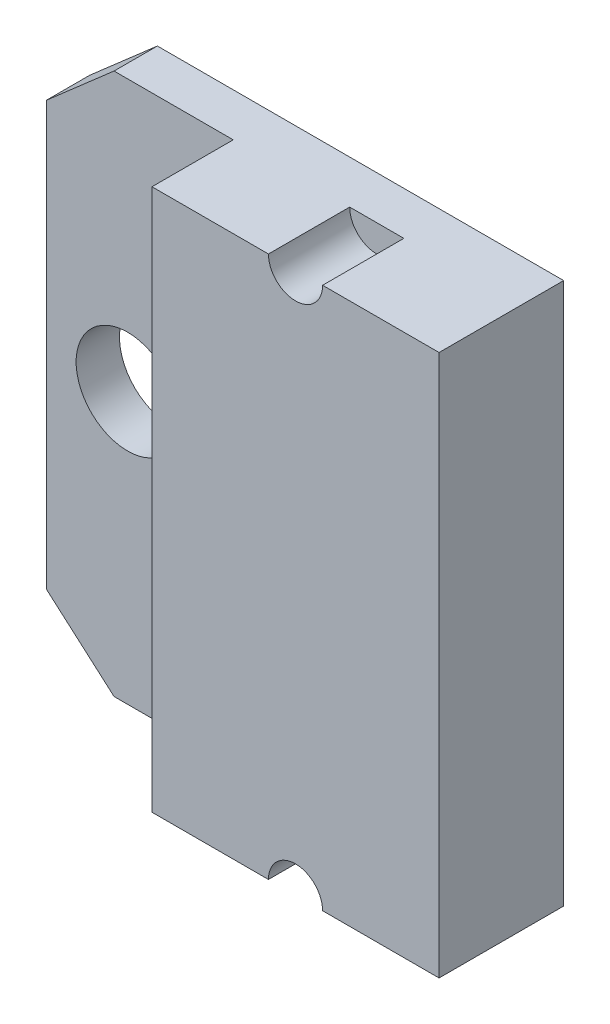
ISO-10303-21;
HEADER;
FILE_DESCRIPTION(('STEP AP214'),'2;1');
FILE_NAME('part.step','',(''),(''),'','','');
FILE_SCHEMA(('AUTOMOTIVE_DESIGN { 1 0 10303 214 1 1 1 1 }'));
ENDSEC;
DATA;
#1=APPLICATION_CONTEXT('core data for automotive mechanical design processes');
#2=APPLICATION_PROTOCOL_DEFINITION('international standard','automotive_design',2000,#1);
#3=PRODUCT_CONTEXT('',#1,'mechanical');
#4=PRODUCT('Part','Part','',(#3));
#5=PRODUCT_RELATED_PRODUCT_CATEGORY('part','',(#4));
#6=PRODUCT_DEFINITION_FORMATION('','',#4);
#7=PRODUCT_DEFINITION_CONTEXT('part definition',#1,'design');
#8=PRODUCT_DEFINITION('design','',#6,#7);
#9=PRODUCT_DEFINITION_SHAPE('','',#8);
#10=(LENGTH_UNIT() NAMED_UNIT(*) SI_UNIT(.MILLI.,.METRE.));
#11=(NAMED_UNIT(*) PLANE_ANGLE_UNIT() SI_UNIT($,.RADIAN.));
#12=(NAMED_UNIT(*) SI_UNIT($,.STERADIAN.) SOLID_ANGLE_UNIT());
#13=UNCERTAINTY_MEASURE_WITH_UNIT(LENGTH_MEASURE(1.E-05),#10,'distance_accuracy_value','');
#14=(GEOMETRIC_REPRESENTATION_CONTEXT(3) GLOBAL_UNCERTAINTY_ASSIGNED_CONTEXT((#13)) GLOBAL_UNIT_ASSIGNED_CONTEXT((#10,
#11,#12)) REPRESENTATION_CONTEXT('',''));
#15=CARTESIAN_POINT('',(0.,0.,0.));
#16=DIRECTION('',(0.,0.,1.));
#17=DIRECTION('',(1.,0.,0.));
#18=AXIS2_PLACEMENT_3D('',#15,#16,#17);
#19=CARTESIAN_POINT('',(0.,0.,1.6));
#20=DIRECTION('',(0.,0.,1.));
#21=DIRECTION('',(1.,0.,0.));
#22=AXIS2_PLACEMENT_3D('',#19,#20,#21);
#23=PLANE('',#22);
#24=DIRECTION('',(0.,-1.,0.));
#25=VECTOR('',#24,1.);
#26=CARTESIAN_POINT('',(-0.599999999999998,8.65,1.6));
#27=LINE('',#26,#25);
#28=CARTESIAN_POINT('',(-0.599999999999998,8.65,1.6));
#29=VERTEX_POINT('',#28);
#30=CARTESIAN_POINT('',(-0.599999999999997,-11.35,1.6));
#31=VERTEX_POINT('',#30);
#32=EDGE_CURVE('E146',#29,#31,#27,.T.);
#33=ORIENTED_EDGE('',*,*,#32,.F.);
#34=DIRECTION('',(-1.,0.,0.));
#35=VECTOR('',#34,1.);
#36=CARTESIAN_POINT('',(10.,8.65,1.6));
#37=LINE('',#36,#35);
#38=CARTESIAN_POINT('',(-5.,8.65,1.6));
#39=VERTEX_POINT('',#38);
#40=EDGE_CURVE('E174',#29,#39,#37,.T.);
#41=ORIENTED_EDGE('',*,*,#40,.T.);
#42=DIRECTION('',(-0.75294294979712,-0.658085795585052,0.));
#43=VECTOR('',#42,1.);
#44=CARTESIAN_POINT('',(-7.5,6.46495465306378,1.6));
#45=LINE('',#44,#43);
#46=CARTESIAN_POINT('',(-7.5,6.46495465306378,1.6));
#47=VERTEX_POINT('',#46);
#48=EDGE_CURVE('E176',#39,#47,#45,.T.);
#49=ORIENTED_EDGE('',*,*,#48,.T.);
#50=DIRECTION('',(0.,-1.,0.));
#51=VECTOR('',#50,1.);
#52=CARTESIAN_POINT('',(-7.5,-9.16495465306377,1.6));
#53=LINE('',#52,#51);
#54=CARTESIAN_POINT('',(-7.5,-9.16495465306377,1.6));
#55=VERTEX_POINT('',#54);
#56=EDGE_CURVE('E179',#47,#55,#53,.T.);
#57=ORIENTED_EDGE('',*,*,#56,.T.);
#58=DIRECTION('',(0.75294294979712,-0.658085795585053,0.));
#59=VECTOR('',#58,1.);
#60=CARTESIAN_POINT('',(-7.5,-9.16495465306377,1.6));
#61=LINE('',#60,#59);
#62=CARTESIAN_POINT('',(-5.,-11.35,1.6));
#63=VERTEX_POINT('',#62);
#64=EDGE_CURVE('E181',#55,#63,#61,.T.);
#65=ORIENTED_EDGE('',*,*,#64,.T.);
#66=DIRECTION('',(1.,0.,0.));
#67=VECTOR('',#66,1.);
#68=CARTESIAN_POINT('',(10.,-11.35,1.6));
#69=LINE('',#68,#67);
#70=EDGE_CURVE('E183',#63,#31,#69,.T.);
#71=ORIENTED_EDGE('',*,*,#70,.T.);
#72=EDGE_LOOP('',(#33,#41,#49,#57,#65,#71));
#73=FACE_BOUND('',#72,.T.);
#74=CARTESIAN_POINT('',(-4.5,-1.35,1.6));
#75=DIRECTION('',(0.,0.,1.));
#76=DIRECTION('',(1.,0.,0.));
#77=AXIS2_PLACEMENT_3D('',#74,#75,#76);
#78=CIRCLE('',#77,1.9);
#79=CARTESIAN_POINT('',(-2.6,-1.35,1.6));
#80=VERTEX_POINT('',#79);
#81=EDGE_CURVE('E168',#80,#80,#78,.T.);
#82=ORIENTED_EDGE('',*,*,#81,.F.);
#83=EDGE_LOOP('',(#82));
#84=FACE_BOUND('',#83,.T.);
#85=ADVANCED_FACE('F32',(#73,#84),#23,.T.);
#86=CARTESIAN_POINT('',(0.,0.,0.));
#87=DIRECTION('',(0.,0.,1.));
#88=DIRECTION('',(1.,0.,0.));
#89=AXIS2_PLACEMENT_3D('',#86,#87,#88);
#90=PLANE('',#89);
#91=DIRECTION('',(0.,1.,0.));
#92=VECTOR('',#91,1.);
#93=CARTESIAN_POINT('',(10.,-11.35,0.));
#94=LINE('',#93,#92);
#95=CARTESIAN_POINT('',(10.,-11.35,0.));
#96=VERTEX_POINT('',#95);
#97=CARTESIAN_POINT('',(10.,8.65,0.));
#98=VERTEX_POINT('',#97);
#99=EDGE_CURVE('E171',#96,#98,#94,.T.);
#100=ORIENTED_EDGE('',*,*,#99,.F.);
#101=DIRECTION('',(1.,0.,0.));
#102=VECTOR('',#101,1.);
#103=CARTESIAN_POINT('',(10.,-11.35,0.));
#104=LINE('',#103,#102);
#105=CARTESIAN_POINT('',(-5.,-11.35,0.));
#106=VERTEX_POINT('',#105);
#107=EDGE_CURVE('E177',#106,#96,#104,.T.);
#108=ORIENTED_EDGE('',*,*,#107,.F.);
#109=DIRECTION('',(0.75294294979712,-0.658085795585053,0.));
#110=VECTOR('',#109,1.);
#111=CARTESIAN_POINT('',(-7.5,-9.16495465306377,0.));
#112=LINE('',#111,#110);
#113=CARTESIAN_POINT('',(-7.5,-9.16495465306377,0.));
#114=VERTEX_POINT('',#113);
#115=EDGE_CURVE('E194',#114,#106,#112,.T.);
#116=ORIENTED_EDGE('',*,*,#115,.F.);
#117=DIRECTION('',(0.,-1.,0.));
#118=VECTOR('',#117,1.);
#119=CARTESIAN_POINT('',(-7.5,-9.16495465306377,0.));
#120=LINE('',#119,#118);
#121=CARTESIAN_POINT('',(-7.5,6.46495465306378,0.));
#122=VERTEX_POINT('',#121);
#123=EDGE_CURVE('E192',#122,#114,#120,.T.);
#124=ORIENTED_EDGE('',*,*,#123,.F.);
#125=DIRECTION('',(-0.75294294979712,-0.658085795585052,0.));
#126=VECTOR('',#125,1.);
#127=CARTESIAN_POINT('',(-7.5,6.46495465306378,0.));
#128=LINE('',#127,#126);
#129=CARTESIAN_POINT('',(-5.,8.65,0.));
#130=VERTEX_POINT('',#129);
#131=EDGE_CURVE('E190',#130,#122,#128,.T.);
#132=ORIENTED_EDGE('',*,*,#131,.F.);
#133=DIRECTION('',(-1.,0.,0.));
#134=VECTOR('',#133,1.);
#135=CARTESIAN_POINT('',(10.,8.65,0.));
#136=LINE('',#135,#134);
#137=EDGE_CURVE('E188',#98,#130,#136,.T.);
#138=ORIENTED_EDGE('',*,*,#137,.F.);
#139=EDGE_LOOP('',(#100,#108,#116,#124,#132,#138));
#140=FACE_BOUND('',#139,.T.);
#141=CARTESIAN_POINT('',(-4.5,-1.35,0.));
#142=DIRECTION('',(0.,0.,1.));
#143=DIRECTION('',(1.,0.,0.));
#144=AXIS2_PLACEMENT_3D('',#141,#142,#143);
#145=CIRCLE('',#144,1.9);
#146=CARTESIAN_POINT('',(-2.6,-1.35,0.));
#147=VERTEX_POINT('',#146);
#148=EDGE_CURVE('E167',#147,#147,#145,.T.);
#149=ORIENTED_EDGE('',*,*,#148,.T.);
#150=EDGE_LOOP('',(#149));
#151=FACE_BOUND('',#150,.T.);
#152=ADVANCED_FACE('F253',(#140,#151),#90,.F.);
#153=CARTESIAN_POINT('',(10.,-11.35,1.6));
#154=DIRECTION('',(-1.,0.,0.));
#155=DIRECTION('',(0.,0.,1.));
#156=AXIS2_PLACEMENT_3D('',#153,#154,#155);
#157=PLANE('',#156);
#158=ORIENTED_EDGE('',*,*,#99,.T.);
#159=DIRECTION('',(0.,0.,-1.));
#160=VECTOR('',#159,1.);
#161=CARTESIAN_POINT('',(10.,8.65,1.6));
#162=LINE('',#161,#160);
#163=CARTESIAN_POINT('',(10.,8.65,4.6));
#164=VERTEX_POINT('',#163);
#165=EDGE_CURVE('E211',#164,#98,#162,.T.);
#166=ORIENTED_EDGE('',*,*,#165,.F.);
#167=DIRECTION('',(0.,1.,0.));
#168=VECTOR('',#167,1.);
#169=CARTESIAN_POINT('',(10.,8.65,4.6));
#170=LINE('',#169,#168);
#171=CARTESIAN_POINT('',(10.,-11.35,4.6));
#172=VERTEX_POINT('',#171);
#173=EDGE_CURVE('E147',#172,#164,#170,.T.);
#174=ORIENTED_EDGE('',*,*,#173,.F.);
#175=DIRECTION('',(0.,0.,-1.));
#176=VECTOR('',#175,1.);
#177=CARTESIAN_POINT('',(10.,-11.35,1.6));
#178=LINE('',#177,#176);
#179=EDGE_CURVE('E185',#172,#96,#178,.T.);
#180=ORIENTED_EDGE('',*,*,#179,.T.);
#181=EDGE_LOOP('',(#158,#166,#174,#180));
#182=FACE_BOUND('',#181,.T.);
#183=ADVANCED_FACE('F34',(#182),#157,.F.);
#184=CARTESIAN_POINT('',(10.,8.65,1.6));
#185=DIRECTION('',(0.,-1.,0.));
#186=DIRECTION('',(1.,0.,0.));
#187=AXIS2_PLACEMENT_3D('',#184,#185,#186);
#188=PLANE('',#187);
#189=DIRECTION('',(1.,0.,0.));
#190=VECTOR('',#189,1.);
#191=CARTESIAN_POINT('',(10.,8.65,1.6));
#192=LINE('',#191,#190);
#193=CARTESIAN_POINT('',(3.7,8.65,1.6));
#194=VERTEX_POINT('',#193);
#195=CARTESIAN_POINT('',(5.7,8.65,1.6));
#196=VERTEX_POINT('',#195);
#197=EDGE_CURVE('E11',#194,#196,#192,.T.);
#198=ORIENTED_EDGE('',*,*,#197,.T.);
#199=DIRECTION('',(0.,0.,1.));
#200=VECTOR('',#199,1.);
#201=CARTESIAN_POINT('',(5.7,8.65,1.6));
#202=LINE('',#201,#200);
#203=CARTESIAN_POINT('',(5.7,8.65,4.6));
#204=VERTEX_POINT('',#203);
#205=EDGE_CURVE('E127',#196,#204,#202,.T.);
#206=ORIENTED_EDGE('',*,*,#205,.T.);
#207=DIRECTION('',(-1.,0.,0.));
#208=VECTOR('',#207,1.);
#209=CARTESIAN_POINT('',(10.,8.65,4.6));
#210=LINE('',#209,#208);
#211=EDGE_CURVE('E150',#164,#204,#210,.T.);
#212=ORIENTED_EDGE('',*,*,#211,.F.);
#213=ORIENTED_EDGE('',*,*,#165,.T.);
#214=ORIENTED_EDGE('',*,*,#137,.T.);
#215=DIRECTION('',(0.,0.,-1.));
#216=VECTOR('',#215,1.);
#217=CARTESIAN_POINT('',(-5.,8.65,1.6));
#218=LINE('',#217,#216);
#219=EDGE_CURVE('E208',#39,#130,#218,.T.);
#220=ORIENTED_EDGE('',*,*,#219,.F.);
#221=ORIENTED_EDGE('',*,*,#40,.F.);
#222=DIRECTION('',(0.,0.,-1.));
#223=VECTOR('',#222,1.);
#224=CARTESIAN_POINT('',(-0.599999999999998,8.65,4.6));
#225=LINE('',#224,#223);
#226=CARTESIAN_POINT('',(-0.599999999999998,8.65,4.6));
#227=VERTEX_POINT('',#226);
#228=EDGE_CURVE('E164',#227,#29,#225,.T.);
#229=ORIENTED_EDGE('',*,*,#228,.F.);
#230=CARTESIAN_POINT('',(3.7,8.65,4.6));
#231=VERTEX_POINT('',#230);
#232=EDGE_CURVE('E134',#231,#227,#210,.T.);
#233=ORIENTED_EDGE('',*,*,#232,.F.);
#234=DIRECTION('',(0.,0.,1.));
#235=VECTOR('',#234,1.);
#236=CARTESIAN_POINT('',(3.7,8.65,1.6));
#237=LINE('',#236,#235);
#238=EDGE_CURVE('E55',#231,#194,#237,.F.);
#239=ORIENTED_EDGE('',*,*,#238,.T.);
#240=EDGE_LOOP('',(#198,#206,#212,#213,#214,#220,#221,#229,#233,#239));
#241=FACE_BOUND('',#240,.T.);
#242=ADVANCED_FACE('F132',(#241),#188,.F.);
#243=CARTESIAN_POINT('',(-7.5,6.46495465306378,1.6));
#244=DIRECTION('',(0.658085795585053,-0.75294294979712,0.));
#245=DIRECTION('',(0.75294294979712,0.658085795585053,0.));
#246=AXIS2_PLACEMENT_3D('',#243,#244,#245);
#247=PLANE('',#246);
#248=ORIENTED_EDGE('',*,*,#131,.T.);
#249=DIRECTION('',(0.,0.,-1.));
#250=VECTOR('',#249,1.);
#251=CARTESIAN_POINT('',(-7.5,6.46495465306378,1.6));
#252=LINE('',#251,#250);
#253=EDGE_CURVE('E205',#47,#122,#252,.T.);
#254=ORIENTED_EDGE('',*,*,#253,.F.);
#255=ORIENTED_EDGE('',*,*,#48,.F.);
#256=ORIENTED_EDGE('',*,*,#219,.T.);
#257=EDGE_LOOP('',(#248,#254,#255,#256));
#258=FACE_BOUND('',#257,.T.);
#259=ADVANCED_FACE('F239',(#258),#247,.F.);
#260=CARTESIAN_POINT('',(-7.5,-9.16495465306377,1.6));
#261=DIRECTION('',(1.,0.,0.));
#262=DIRECTION('',(0.,0.,-1.));
#263=AXIS2_PLACEMENT_3D('',#260,#261,#262);
#264=PLANE('',#263);
#265=ORIENTED_EDGE('',*,*,#123,.T.);
#266=DIRECTION('',(0.,0.,-1.));
#267=VECTOR('',#266,1.);
#268=CARTESIAN_POINT('',(-7.5,-9.16495465306377,1.6));
#269=LINE('',#268,#267);
#270=EDGE_CURVE('E202',#55,#114,#269,.T.);
#271=ORIENTED_EDGE('',*,*,#270,.F.);
#272=ORIENTED_EDGE('',*,*,#56,.F.);
#273=ORIENTED_EDGE('',*,*,#253,.T.);
#274=EDGE_LOOP('',(#265,#271,#272,#273));
#275=FACE_BOUND('',#274,.T.);
#276=ADVANCED_FACE('F245',(#275),#264,.F.);
#277=CARTESIAN_POINT('',(-7.5,-9.16495465306377,1.6));
#278=DIRECTION('',(0.658085795585053,0.75294294979712,0.));
#279=DIRECTION('',(-0.75294294979712,0.658085795585053,0.));
#280=AXIS2_PLACEMENT_3D('',#277,#278,#279);
#281=PLANE('',#280);
#282=ORIENTED_EDGE('',*,*,#115,.T.);
#283=DIRECTION('',(0.,0.,-1.));
#284=VECTOR('',#283,1.);
#285=CARTESIAN_POINT('',(-5.,-11.35,1.6));
#286=LINE('',#285,#284);
#287=EDGE_CURVE('E199',#63,#106,#286,.T.);
#288=ORIENTED_EDGE('',*,*,#287,.F.);
#289=ORIENTED_EDGE('',*,*,#64,.F.);
#290=ORIENTED_EDGE('',*,*,#270,.T.);
#291=EDGE_LOOP('',(#282,#288,#289,#290));
#292=FACE_BOUND('',#291,.T.);
#293=ADVANCED_FACE('F249',(#292),#281,.F.);
#294=CARTESIAN_POINT('',(10.,-11.35,1.6));
#295=DIRECTION('',(0.,1.,0.));
#296=DIRECTION('',(0.,0.,1.));
#297=AXIS2_PLACEMENT_3D('',#294,#295,#296);
#298=PLANE('',#297);
#299=DIRECTION('',(1.,0.,0.));
#300=VECTOR('',#299,1.);
#301=CARTESIAN_POINT('',(10.,-11.35,1.6));
#302=LINE('',#301,#300);
#303=CARTESIAN_POINT('',(3.7,-11.35,1.6));
#304=VERTEX_POINT('',#303);
#305=CARTESIAN_POINT('',(5.7,-11.35,1.6));
#306=VERTEX_POINT('',#305);
#307=EDGE_CURVE('E40',#304,#306,#302,.T.);
#308=ORIENTED_EDGE('',*,*,#307,.F.);
#309=DIRECTION('',(0.,0.,1.));
#310=VECTOR('',#309,1.);
#311=CARTESIAN_POINT('',(3.7,-11.35,1.6));
#312=LINE('',#311,#310);
#313=CARTESIAN_POINT('',(3.7,-11.35,4.6));
#314=VERTEX_POINT('',#313);
#315=EDGE_CURVE('E143',#304,#314,#312,.T.);
#316=ORIENTED_EDGE('',*,*,#315,.T.);
#317=DIRECTION('',(1.,0.,0.));
#318=VECTOR('',#317,1.);
#319=CARTESIAN_POINT('',(10.,-11.35,4.6));
#320=LINE('',#319,#318);
#321=CARTESIAN_POINT('',(-0.599999999999997,-11.35,4.6));
#322=VERTEX_POINT('',#321);
#323=EDGE_CURVE('E156',#322,#314,#320,.T.);
#324=ORIENTED_EDGE('',*,*,#323,.F.);
#325=DIRECTION('',(0.,0.,-1.));
#326=VECTOR('',#325,1.);
#327=CARTESIAN_POINT('',(-0.599999999999997,-11.35,4.6));
#328=LINE('',#327,#326);
#329=EDGE_CURVE('E159',#322,#31,#328,.T.);
#330=ORIENTED_EDGE('',*,*,#329,.T.);
#331=ORIENTED_EDGE('',*,*,#70,.F.);
#332=ORIENTED_EDGE('',*,*,#287,.T.);
#333=ORIENTED_EDGE('',*,*,#107,.T.);
#334=ORIENTED_EDGE('',*,*,#179,.F.);
#335=CARTESIAN_POINT('',(5.7,-11.35,4.6));
#336=VERTEX_POINT('',#335);
#337=EDGE_CURVE('E155',#336,#172,#320,.T.);
#338=ORIENTED_EDGE('',*,*,#337,.F.);
#339=DIRECTION('',(0.,0.,1.));
#340=VECTOR('',#339,1.);
#341=CARTESIAN_POINT('',(5.7,-11.35,1.6));
#342=LINE('',#341,#340);
#343=EDGE_CURVE('E47',#336,#306,#342,.F.);
#344=ORIENTED_EDGE('',*,*,#343,.T.);
#345=EDGE_LOOP('',(#308,#316,#324,#330,#331,#332,#333,#334,#338,#344));
#346=FACE_BOUND('',#345,.T.);
#347=ADVANCED_FACE('F219',(#346),#298,.F.);
#348=CARTESIAN_POINT('',(-4.5,-1.35,1.6));
#349=DIRECTION('',(0.,0.,-1.));
#350=DIRECTION('',(-1.,0.,0.));
#351=AXIS2_PLACEMENT_3D('',#348,#349,#350);
#352=CYLINDRICAL_SURFACE('',#351,1.9);
#353=ORIENTED_EDGE('',*,*,#81,.T.);
#354=EDGE_LOOP('',(#353));
#355=FACE_BOUND('',#354,.T.);
#356=ORIENTED_EDGE('',*,*,#148,.F.);
#357=EDGE_LOOP('',(#356));
#358=FACE_BOUND('',#357,.T.);
#359=ADVANCED_FACE('F268',(#355,#358),#352,.F.);
#360=CARTESIAN_POINT('',(-0.599999999999998,8.65,4.6));
#361=DIRECTION('',(1.,0.,0.));
#362=DIRECTION('',(0.,1.,0.));
#363=AXIS2_PLACEMENT_3D('',#360,#361,#362);
#364=PLANE('',#363);
#365=ORIENTED_EDGE('',*,*,#32,.T.);
#366=ORIENTED_EDGE('',*,*,#329,.F.);
#367=DIRECTION('',(0.,-1.,0.));
#368=VECTOR('',#367,1.);
#369=CARTESIAN_POINT('',(-0.599999999999998,8.65,4.6));
#370=LINE('',#369,#368);
#371=EDGE_CURVE('E153',#227,#322,#370,.T.);
#372=ORIENTED_EDGE('',*,*,#371,.F.);
#373=ORIENTED_EDGE('',*,*,#228,.T.);
#374=EDGE_LOOP('',(#365,#366,#372,#373));
#375=FACE_BOUND('',#374,.T.);
#376=ADVANCED_FACE('F230',(#375),#364,.F.);
#377=CARTESIAN_POINT('',(0.,0.,4.6));
#378=DIRECTION('',(0.,0.,-1.));
#379=DIRECTION('',(-1.,0.,0.));
#380=AXIS2_PLACEMENT_3D('',#377,#378,#379);
#381=PLANE('',#380);
#382=ORIENTED_EDGE('',*,*,#323,.T.);
#383=CARTESIAN_POINT('',(4.7,-11.35,4.6));
#384=DIRECTION('',(0.,0.,1.));
#385=DIRECTION('',(1.,0.,0.));
#386=AXIS2_PLACEMENT_3D('',#383,#384,#385);
#387=CIRCLE('',#386,1.);
#388=EDGE_CURVE('E128',#336,#314,#387,.T.);
#389=ORIENTED_EDGE('',*,*,#388,.F.);
#390=ORIENTED_EDGE('',*,*,#337,.T.);
#391=ORIENTED_EDGE('',*,*,#173,.T.);
#392=ORIENTED_EDGE('',*,*,#211,.T.);
#393=CARTESIAN_POINT('',(4.7,8.65,4.6));
#394=DIRECTION('',(0.,0.,1.));
#395=DIRECTION('',(-1.,0.,0.));
#396=AXIS2_PLACEMENT_3D('',#393,#394,#395);
#397=CIRCLE('',#396,0.999999999999999);
#398=EDGE_CURVE('E129',#231,#204,#397,.T.);
#399=ORIENTED_EDGE('',*,*,#398,.F.);
#400=ORIENTED_EDGE('',*,*,#232,.T.);
#401=ORIENTED_EDGE('',*,*,#371,.T.);
#402=EDGE_LOOP('',(#382,#389,#390,#391,#392,#399,#400,#401));
#403=FACE_BOUND('',#402,.T.);
#404=ADVANCED_FACE('F223',(#403),#381,.F.);
#405=CARTESIAN_POINT('',(4.7,8.65,1.6));
#406=DIRECTION('',(0.,0.,-1.));
#407=DIRECTION('',(-1.,0.,0.));
#408=AXIS2_PLACEMENT_3D('',#405,#406,#407);
#409=PLANE('',#408);
#410=CARTESIAN_POINT('',(4.7,8.65,1.6));
#411=DIRECTION('',(0.,0.,1.));
#412=DIRECTION('',(-1.,0.,0.));
#413=AXIS2_PLACEMENT_3D('',#410,#411,#412);
#414=CIRCLE('',#413,0.999999999999999);
#415=EDGE_CURVE('E123',#194,#196,#414,.T.);
#416=ORIENTED_EDGE('',*,*,#415,.T.);
#417=ORIENTED_EDGE('',*,*,#197,.F.);
#418=EDGE_LOOP('',(#416,#417));
#419=FACE_BOUND('',#418,.T.);
#420=ADVANCED_FACE('F122',(#419),#409,.F.);
#421=CARTESIAN_POINT('',(4.7,8.65,1.6));
#422=DIRECTION('',(0.,0.,1.));
#423=DIRECTION('',(1.,0.,0.));
#424=AXIS2_PLACEMENT_3D('',#421,#422,#423);
#425=CYLINDRICAL_SURFACE('',#424,0.999999999999999);
#426=ORIENTED_EDGE('',*,*,#415,.F.);
#427=ORIENTED_EDGE('',*,*,#238,.F.);
#428=ORIENTED_EDGE('',*,*,#398,.T.);
#429=ORIENTED_EDGE('',*,*,#205,.F.);
#430=EDGE_LOOP('',(#426,#427,#428,#429));
#431=FACE_BOUND('',#430,.T.);
#432=ADVANCED_FACE('F126',(#431),#425,.F.);
#433=CARTESIAN_POINT('',(4.7,-11.35,1.6));
#434=DIRECTION('',(0.,0.,1.));
#435=DIRECTION('',(1.,0.,0.));
#436=AXIS2_PLACEMENT_3D('',#433,#434,#435);
#437=PLANE('',#436);
#438=ORIENTED_EDGE('',*,*,#307,.T.);
#439=CARTESIAN_POINT('',(4.7,-11.35,1.6));
#440=DIRECTION('',(0.,0.,1.));
#441=DIRECTION('',(1.,0.,0.));
#442=AXIS2_PLACEMENT_3D('',#439,#440,#441);
#443=CIRCLE('',#442,1.);
#444=EDGE_CURVE('E135',#306,#304,#443,.T.);
#445=ORIENTED_EDGE('',*,*,#444,.T.);
#446=EDGE_LOOP('',(#438,#445));
#447=FACE_BOUND('',#446,.T.);
#448=ADVANCED_FACE('F215',(#447),#437,.T.);
#449=CARTESIAN_POINT('',(4.7,-11.35,1.6));
#450=DIRECTION('',(0.,0.,1.));
#451=DIRECTION('',(1.,0.,0.));
#452=AXIS2_PLACEMENT_3D('',#449,#450,#451);
#453=CYLINDRICAL_SURFACE('',#452,1.);
#454=ORIENTED_EDGE('',*,*,#444,.F.);
#455=ORIENTED_EDGE('',*,*,#343,.F.);
#456=ORIENTED_EDGE('',*,*,#388,.T.);
#457=ORIENTED_EDGE('',*,*,#315,.F.);
#458=EDGE_LOOP('',(#454,#455,#456,#457));
#459=FACE_BOUND('',#458,.T.);
#460=ADVANCED_FACE('F217',(#459),#453,.F.);
#461=CLOSED_SHELL('',(#85,#152,#183,#242,#259,#276,#293,#347,#359,#376,#404,#420,#432,#448,#460));
#462=MANIFOLD_SOLID_BREP('B2',#461);
#463=ADVANCED_BREP_SHAPE_REPRESENTATION('',(#18,#462),#14);
#464=SHAPE_DEFINITION_REPRESENTATION(#9,#463);
ENDSEC;
END-ISO-10303-21;
